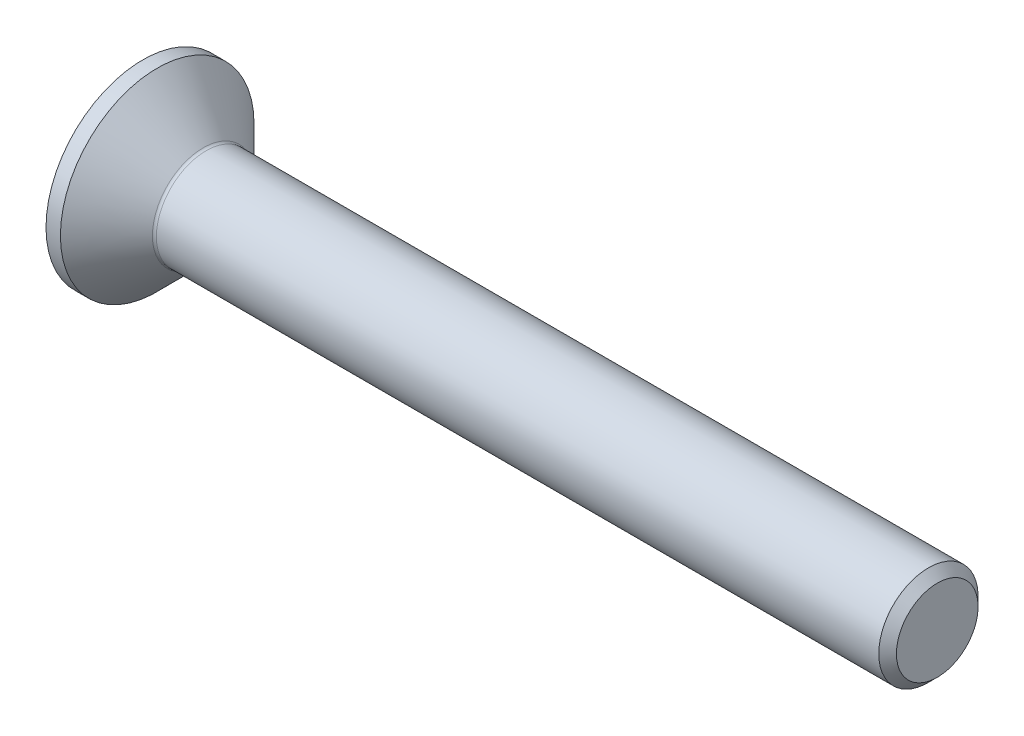
ISO-10303-21;
HEADER;
FILE_DESCRIPTION(('STEP AP214'),'2;1');
FILE_NAME('part.step','',(''),(''),'','','');
FILE_SCHEMA(('AUTOMOTIVE_DESIGN { 1 0 10303 214 1 1 1 1 }'));
ENDSEC;
DATA;
#1=APPLICATION_CONTEXT('core data for automotive mechanical design processes');
#2=APPLICATION_PROTOCOL_DEFINITION('international standard','automotive_design',2000,#1);
#3=PRODUCT_CONTEXT('',#1,'mechanical');
#4=PRODUCT('Part','Part','',(#3));
#5=PRODUCT_RELATED_PRODUCT_CATEGORY('part','',(#4));
#6=PRODUCT_DEFINITION_FORMATION('','',#4);
#7=PRODUCT_DEFINITION_CONTEXT('part definition',#1,'design');
#8=PRODUCT_DEFINITION('design','',#6,#7);
#9=PRODUCT_DEFINITION_SHAPE('','',#8);
#10=(LENGTH_UNIT() NAMED_UNIT(*) SI_UNIT(.MILLI.,.METRE.));
#11=(NAMED_UNIT(*) PLANE_ANGLE_UNIT() SI_UNIT($,.RADIAN.));
#12=(NAMED_UNIT(*) SI_UNIT($,.STERADIAN.) SOLID_ANGLE_UNIT());
#13=UNCERTAINTY_MEASURE_WITH_UNIT(LENGTH_MEASURE(1.E-05),#10,'distance_accuracy_value','');
#14=(GEOMETRIC_REPRESENTATION_CONTEXT(3) GLOBAL_UNCERTAINTY_ASSIGNED_CONTEXT((#13)) GLOBAL_UNIT_ASSIGNED_CONTEXT((#10,
#11,#12)) REPRESENTATION_CONTEXT('',''));
#15=CARTESIAN_POINT('',(0.,0.,0.));
#16=DIRECTION('',(0.,0.,1.));
#17=DIRECTION('',(1.,0.,0.));
#18=AXIS2_PLACEMENT_3D('',#15,#16,#17);
#19=CARTESIAN_POINT('',(0.,0.,0.));
#20=DIRECTION('',(-1.,0.,0.));
#21=DIRECTION('',(0.,0.,1.));
#22=AXIS2_PLACEMENT_3D('',#19,#20,#21);
#23=PLANE('',#22);
#24=CARTESIAN_POINT('',(0.,0.,0.));
#25=DIRECTION('',(-1.,0.,0.));
#26=DIRECTION('',(0.,0.,1.));
#27=AXIS2_PLACEMENT_3D('',#24,#25,#26);
#28=CIRCLE('',#27,4.875);
#29=CARTESIAN_POINT('',(0.,0.,4.875));
#30=VERTEX_POINT('',#29);
#31=EDGE_CURVE('E158',#30,#30,#28,.T.);
#32=ORIENTED_EDGE('',*,*,#31,.T.);
#33=EDGE_LOOP('',(#32));
#34=FACE_BOUND('',#33,.T.);
#35=DIRECTION('',(0.,-0.5,-0.866025403784439));
#36=VECTOR('',#35,1.);
#37=CARTESIAN_POINT('',(0.,-0.866025403784439,1.5));
#38=LINE('',#37,#36);
#39=CARTESIAN_POINT('',(0.,-0.866025403784439,1.5));
#40=VERTEX_POINT('',#39);
#41=CARTESIAN_POINT('',(0.,-1.73205080756888,0.));
#42=VERTEX_POINT('',#41);
#43=EDGE_CURVE('E120',#40,#42,#38,.T.);
#44=ORIENTED_EDGE('',*,*,#43,.T.);
#45=DIRECTION('',(0.,0.500000000000001,-0.866025403784438));
#46=VECTOR('',#45,1.);
#47=CARTESIAN_POINT('',(0.,-1.73205080756888,0.));
#48=LINE('',#47,#46);
#49=CARTESIAN_POINT('',(0.,-0.866025403784438,-1.5));
#50=VERTEX_POINT('',#49);
#51=EDGE_CURVE('E50',#42,#50,#48,.T.);
#52=ORIENTED_EDGE('',*,*,#51,.T.);
#53=DIRECTION('',(0.,1.,0.));
#54=VECTOR('',#53,1.);
#55=CARTESIAN_POINT('',(0.,-0.866025403784438,-1.5));
#56=LINE('',#55,#54);
#57=CARTESIAN_POINT('',(0.,0.866025403784438,-1.5));
#58=VERTEX_POINT('',#57);
#59=EDGE_CURVE('E135',#50,#58,#56,.T.);
#60=ORIENTED_EDGE('',*,*,#59,.T.);
#61=DIRECTION('',(0.,0.499999999999999,0.866025403784439));
#62=VECTOR('',#61,1.);
#63=CARTESIAN_POINT('',(0.,0.866025403784438,-1.5));
#64=LINE('',#63,#62);
#65=CARTESIAN_POINT('',(0.,1.73205080756888,0.));
#66=VERTEX_POINT('',#65);
#67=EDGE_CURVE('E271',#58,#66,#64,.T.);
#68=ORIENTED_EDGE('',*,*,#67,.T.);
#69=DIRECTION('',(0.,-0.5,0.866025403784439));
#70=VECTOR('',#69,1.);
#71=CARTESIAN_POINT('',(0.,1.73205080756888,0.));
#72=LINE('',#71,#70);
#73=CARTESIAN_POINT('',(0.,0.866025403784438,1.5));
#74=VERTEX_POINT('',#73);
#75=EDGE_CURVE('E274',#66,#74,#72,.T.);
#76=ORIENTED_EDGE('',*,*,#75,.T.);
#77=DIRECTION('',(0.,-1.,0.));
#78=VECTOR('',#77,1.);
#79=CARTESIAN_POINT('',(0.,0.866025403784438,1.5));
#80=LINE('',#79,#78);
#81=EDGE_CURVE('E277',#74,#40,#80,.T.);
#82=ORIENTED_EDGE('',*,*,#81,.T.);
#83=EDGE_LOOP('',(#44,#52,#60,#68,#76,#82));
#84=FACE_BOUND('',#83,.T.);
#85=ADVANCED_FACE('F35',(#34,#84),#23,.T.);
#86=CARTESIAN_POINT('',(0.,0.,0.));
#87=DIRECTION('',(-1.,0.,0.));
#88=DIRECTION('',(0.,0.,1.));
#89=AXIS2_PLACEMENT_3D('',#86,#87,#88);
#90=CYLINDRICAL_SURFACE('',#89,4.875);
#91=CARTESIAN_POINT('',(0.725000000000013,0.,0.));
#92=DIRECTION('',(-1.,0.,0.));
#93=DIRECTION('',(0.,0.,1.));
#94=AXIS2_PLACEMENT_3D('',#91,#92,#93);
#95=CIRCLE('',#94,4.875);
#96=CARTESIAN_POINT('',(0.725000000000013,0.,4.875));
#97=VERTEX_POINT('',#96);
#98=EDGE_CURVE('E155',#97,#97,#95,.T.);
#99=ORIENTED_EDGE('',*,*,#98,.T.);
#100=EDGE_LOOP('',(#99));
#101=FACE_BOUND('',#100,.T.);
#102=ORIENTED_EDGE('',*,*,#31,.F.);
#103=EDGE_LOOP('',(#102));
#104=FACE_BOUND('',#103,.T.);
#105=ADVANCED_FACE('F179',(#101,#104),#90,.T.);
#106=CARTESIAN_POINT('',(0.725000000000013,0.,0.));
#107=DIRECTION('',(-1.,0.,0.));
#108=DIRECTION('',(0.,0.,1.));
#109=AXIS2_PLACEMENT_3D('',#106,#107,#108);
#110=CONICAL_SURFACE('',#109,4.875,0.78539816339745);
#111=CARTESIAN_POINT('',(3.04142135623745,0.,0.));
#112=DIRECTION('',(-1.,0.,0.));
#113=DIRECTION('',(0.,0.,1.));
#114=AXIS2_PLACEMENT_3D('',#111,#112,#113);
#115=CIRCLE('',#114,2.55857864376256);
#116=CARTESIAN_POINT('',(3.04142135623745,0.,2.55857864376256));
#117=VERTEX_POINT('',#116);
#118=EDGE_CURVE('E43',#117,#117,#115,.T.);
#119=ORIENTED_EDGE('',*,*,#118,.T.);
#120=EDGE_LOOP('',(#119));
#121=FACE_BOUND('',#120,.T.);
#122=ORIENTED_EDGE('',*,*,#98,.F.);
#123=EDGE_LOOP('',(#122));
#124=FACE_BOUND('',#123,.T.);
#125=ADVANCED_FACE('F163',(#121,#124),#110,.T.);
#126=CARTESIAN_POINT('',(0.,0.,0.));
#127=DIRECTION('',(-1.,0.,0.));
#128=DIRECTION('',(0.,0.,1.));
#129=AXIS2_PLACEMENT_3D('',#126,#127,#128);
#130=CYLINDRICAL_SURFACE('',#129,2.49999999999987);
#131=CARTESIAN_POINT('',(3.18284271247476,0.,0.));
#132=DIRECTION('',(-1.,0.,0.));
#133=DIRECTION('',(0.,0.,1.));
#134=AXIS2_PLACEMENT_3D('',#131,#132,#133);
#135=CIRCLE('',#134,2.49999999999987);
#136=CARTESIAN_POINT('',(3.18284271247476,0.,2.49999999999987));
#137=VERTEX_POINT('',#136);
#138=EDGE_CURVE('E11',#137,#137,#135,.F.);
#139=ORIENTED_EDGE('',*,*,#138,.T.);
#140=EDGE_LOOP('',(#139));
#141=FACE_BOUND('',#140,.T.);
#142=CARTESIAN_POINT('',(39.5549999999997,0.,0.));
#143=DIRECTION('',(-1.,0.,0.));
#144=DIRECTION('',(0.,0.,1.));
#145=AXIS2_PLACEMENT_3D('',#142,#143,#144);
#146=CIRCLE('',#145,2.49999999999973);
#147=CARTESIAN_POINT('',(39.5549999999997,0.,2.49999999999973));
#148=VERTEX_POINT('',#147);
#149=EDGE_CURVE('E152',#148,#148,#146,.T.);
#150=ORIENTED_EDGE('',*,*,#149,.T.);
#151=EDGE_LOOP('',(#150));
#152=FACE_BOUND('',#151,.T.);
#153=ADVANCED_FACE('F190',(#141,#152),#130,.T.);
#154=CARTESIAN_POINT('',(40.,0.,0.));
#155=DIRECTION('',(-1.,0.,0.));
#156=DIRECTION('',(0.,0.,1.));
#157=AXIS2_PLACEMENT_3D('',#154,#155,#156);
#158=CONICAL_SURFACE('',#157,2.055,0.785398163396857);
#159=ORIENTED_EDGE('',*,*,#149,.F.);
#160=EDGE_LOOP('',(#159));
#161=FACE_BOUND('',#160,.T.);
#162=CARTESIAN_POINT('',(40.,0.,0.));
#163=DIRECTION('',(-1.,0.,0.));
#164=DIRECTION('',(0.,0.,1.));
#165=AXIS2_PLACEMENT_3D('',#162,#163,#164);
#166=CIRCLE('',#165,2.055);
#167=CARTESIAN_POINT('',(40.,0.,2.055));
#168=VERTEX_POINT('',#167);
#169=EDGE_CURVE('E148',#168,#168,#166,.T.);
#170=ORIENTED_EDGE('',*,*,#169,.T.);
#171=EDGE_LOOP('',(#170));
#172=FACE_BOUND('',#171,.T.);
#173=ADVANCED_FACE('F174',(#161,#172),#158,.T.);
#174=CARTESIAN_POINT('',(40.,2.055,0.));
#175=DIRECTION('',(1.,0.,0.));
#176=DIRECTION('',(0.,0.,-1.));
#177=AXIS2_PLACEMENT_3D('',#174,#175,#176);
#178=PLANE('',#177);
#179=ORIENTED_EDGE('',*,*,#169,.F.);
#180=EDGE_LOOP('',(#179));
#181=FACE_BOUND('',#180,.T.);
#182=ADVANCED_FACE('F167',(#181),#178,.T.);
#183=CARTESIAN_POINT('',(3.18284271247476,0.,0.));
#184=DIRECTION('',(-1.,0.,0.));
#185=DIRECTION('',(0.,0.,1.));
#186=AXIS2_PLACEMENT_3D('',#183,#184,#185);
#187=TOROIDAL_SURFACE('',#186,2.69999999999987,0.2);
#188=ORIENTED_EDGE('',*,*,#138,.F.);
#189=EDGE_LOOP('',(#188));
#190=FACE_BOUND('',#189,.T.);
#191=ORIENTED_EDGE('',*,*,#118,.F.);
#192=EDGE_LOOP('',(#191));
#193=FACE_BOUND('',#192,.T.);
#194=ADVANCED_FACE('F37',(#190,#193),#187,.F.);
#195=CARTESIAN_POINT('',(1.9,-1.73205080756888,0.));
#196=DIRECTION('',(0.,0.866025403784438,0.500000000000001));
#197=DIRECTION('',(0.,-0.500000000000001,0.866025403784438));
#198=AXIS2_PLACEMENT_3D('',#195,#196,#197);
#199=PLANE('',#198);
#200=ORIENTED_EDGE('',*,*,#51,.F.);
#201=DIRECTION('',(-1.,0.,0.));
#202=VECTOR('',#201,1.);
#203=CARTESIAN_POINT('',(1.9,-1.73205080756888,0.));
#204=LINE('',#203,#202);
#205=CARTESIAN_POINT('',(1.9,-1.73205080756888,0.));
#206=VERTEX_POINT('',#205);
#207=EDGE_CURVE('E268',#206,#42,#204,.T.);
#208=ORIENTED_EDGE('',*,*,#207,.F.);
#209=DIRECTION('',(0.,0.500000000000001,-0.866025403784438));
#210=VECTOR('',#209,1.);
#211=CARTESIAN_POINT('',(1.9,-1.73205080756888,0.));
#212=LINE('',#211,#210);
#213=CARTESIAN_POINT('',(1.9,-1.29903810567666,-0.750000000000001));
#214=VERTEX_POINT('',#213);
#215=EDGE_CURVE('E117',#206,#214,#212,.T.);
#216=ORIENTED_EDGE('',*,*,#215,.T.);
#217=CARTESIAN_POINT('',(1.9,-0.866025403784438,-1.5));
#218=VERTEX_POINT('',#217);
#219=EDGE_CURVE('E111',#214,#218,#212,.T.);
#220=ORIENTED_EDGE('',*,*,#219,.T.);
#221=DIRECTION('',(-1.,0.,0.));
#222=VECTOR('',#221,1.);
#223=CARTESIAN_POINT('',(1.9,-0.866025403784438,-1.5));
#224=LINE('',#223,#222);
#225=EDGE_CURVE('E115',#218,#50,#224,.T.);
#226=ORIENTED_EDGE('',*,*,#225,.T.);
#227=EDGE_LOOP('',(#200,#208,#216,#220,#226));
#228=FACE_BOUND('',#227,.T.);
#229=ADVANCED_FACE('F113',(#228),#199,.T.);
#230=CARTESIAN_POINT('',(1.9,-0.866025403784438,-1.5));
#231=DIRECTION('',(0.,0.,1.));
#232=DIRECTION('',(0.,-1.,0.));
#233=AXIS2_PLACEMENT_3D('',#230,#231,#232);
#234=PLANE('',#233);
#235=ORIENTED_EDGE('',*,*,#59,.F.);
#236=ORIENTED_EDGE('',*,*,#225,.F.);
#237=DIRECTION('',(0.,1.,0.));
#238=VECTOR('',#237,1.);
#239=CARTESIAN_POINT('',(1.9,-0.866025403784438,-1.5));
#240=LINE('',#239,#238);
#241=CARTESIAN_POINT('',(1.9,0.,-1.5));
#242=VERTEX_POINT('',#241);
#243=EDGE_CURVE('E123',#218,#242,#240,.T.);
#244=ORIENTED_EDGE('',*,*,#243,.T.);
#245=CARTESIAN_POINT('',(1.9,0.866025403784438,-1.5));
#246=VERTEX_POINT('',#245);
#247=EDGE_CURVE('E130',#242,#246,#240,.T.);
#248=ORIENTED_EDGE('',*,*,#247,.T.);
#249=DIRECTION('',(-1.,0.,0.));
#250=VECTOR('',#249,1.);
#251=CARTESIAN_POINT('',(1.9,0.866025403784438,-1.5));
#252=LINE('',#251,#250);
#253=EDGE_CURVE('E137',#246,#58,#252,.T.);
#254=ORIENTED_EDGE('',*,*,#253,.T.);
#255=EDGE_LOOP('',(#235,#236,#244,#248,#254));
#256=FACE_BOUND('',#255,.T.);
#257=ADVANCED_FACE('F132',(#256),#234,.T.);
#258=CARTESIAN_POINT('',(1.9,0.866025403784438,-1.5));
#259=DIRECTION('',(0.,-0.866025403784439,0.499999999999999));
#260=DIRECTION('',(0.,-0.499999999999999,-0.866025403784439));
#261=AXIS2_PLACEMENT_3D('',#258,#259,#260);
#262=PLANE('',#261);
#263=ORIENTED_EDGE('',*,*,#67,.F.);
#264=ORIENTED_EDGE('',*,*,#253,.F.);
#265=DIRECTION('',(0.,0.499999999999999,0.866025403784439));
#266=VECTOR('',#265,1.);
#267=CARTESIAN_POINT('',(1.9,0.866025403784438,-1.5));
#268=LINE('',#267,#266);
#269=CARTESIAN_POINT('',(1.9,1.29903810567666,-0.749999999999998));
#270=VERTEX_POINT('',#269);
#271=EDGE_CURVE('E260',#246,#270,#268,.T.);
#272=ORIENTED_EDGE('',*,*,#271,.T.);
#273=CARTESIAN_POINT('',(1.9,1.73205080756888,0.));
#274=VERTEX_POINT('',#273);
#275=EDGE_CURVE('E129',#270,#274,#268,.T.);
#276=ORIENTED_EDGE('',*,*,#275,.T.);
#277=DIRECTION('',(-1.,0.,0.));
#278=VECTOR('',#277,1.);
#279=CARTESIAN_POINT('',(1.9,1.73205080756888,0.));
#280=LINE('',#279,#278);
#281=EDGE_CURVE('E143',#274,#66,#280,.T.);
#282=ORIENTED_EDGE('',*,*,#281,.T.);
#283=EDGE_LOOP('',(#263,#264,#272,#276,#282));
#284=FACE_BOUND('',#283,.T.);
#285=ADVANCED_FACE('F204',(#284),#262,.T.);
#286=CARTESIAN_POINT('',(1.9,1.73205080756888,0.));
#287=DIRECTION('',(0.,-0.866025403784439,-0.5));
#288=DIRECTION('',(0.,0.5,-0.866025403784439));
#289=AXIS2_PLACEMENT_3D('',#286,#287,#288);
#290=PLANE('',#289);
#291=ORIENTED_EDGE('',*,*,#75,.F.);
#292=ORIENTED_EDGE('',*,*,#281,.F.);
#293=DIRECTION('',(0.,-0.5,0.866025403784439));
#294=VECTOR('',#293,1.);
#295=CARTESIAN_POINT('',(1.9,1.73205080756888,0.));
#296=LINE('',#295,#294);
#297=CARTESIAN_POINT('',(1.9,1.29903810567666,0.749999999999999));
#298=VERTEX_POINT('',#297);
#299=EDGE_CURVE('E58',#274,#298,#296,.T.);
#300=ORIENTED_EDGE('',*,*,#299,.T.);
#301=CARTESIAN_POINT('',(1.9,0.866025403784438,1.5));
#302=VERTEX_POINT('',#301);
#303=EDGE_CURVE('E239',#298,#302,#296,.T.);
#304=ORIENTED_EDGE('',*,*,#303,.T.);
#305=DIRECTION('',(-1.,0.,0.));
#306=VECTOR('',#305,1.);
#307=CARTESIAN_POINT('',(1.9,0.866025403784438,1.5));
#308=LINE('',#307,#306);
#309=EDGE_CURVE('E253',#302,#74,#308,.T.);
#310=ORIENTED_EDGE('',*,*,#309,.T.);
#311=EDGE_LOOP('',(#291,#292,#300,#304,#310));
#312=FACE_BOUND('',#311,.T.);
#313=ADVANCED_FACE('F207',(#312),#290,.T.);
#314=CARTESIAN_POINT('',(1.9,0.866025403784438,1.5));
#315=DIRECTION('',(0.,0.,-1.));
#316=DIRECTION('',(0.,1.,0.));
#317=AXIS2_PLACEMENT_3D('',#314,#315,#316);
#318=PLANE('',#317);
#319=ORIENTED_EDGE('',*,*,#81,.F.);
#320=ORIENTED_EDGE('',*,*,#309,.F.);
#321=DIRECTION('',(0.,-1.,0.));
#322=VECTOR('',#321,1.);
#323=CARTESIAN_POINT('',(1.9,0.866025403784438,1.5));
#324=LINE('',#323,#322);
#325=CARTESIAN_POINT('',(1.9,0.,1.5));
#326=VERTEX_POINT('',#325);
#327=EDGE_CURVE('E238',#302,#326,#324,.T.);
#328=ORIENTED_EDGE('',*,*,#327,.T.);
#329=CARTESIAN_POINT('',(1.9,-0.866025403784439,1.5));
#330=VERTEX_POINT('',#329);
#331=EDGE_CURVE('E244',#326,#330,#324,.T.);
#332=ORIENTED_EDGE('',*,*,#331,.T.);
#333=DIRECTION('',(-1.,0.,0.));
#334=VECTOR('',#333,1.);
#335=CARTESIAN_POINT('',(1.9,-0.866025403784439,1.5));
#336=LINE('',#335,#334);
#337=EDGE_CURVE('E283',#330,#40,#336,.T.);
#338=ORIENTED_EDGE('',*,*,#337,.T.);
#339=EDGE_LOOP('',(#319,#320,#328,#332,#338));
#340=FACE_BOUND('',#339,.T.);
#341=ADVANCED_FACE('F211',(#340),#318,.T.);
#342=CARTESIAN_POINT('',(1.9,-0.866025403784439,1.5));
#343=DIRECTION('',(0.,0.866025403784438,-0.5));
#344=DIRECTION('',(0.,0.5,0.866025403784439));
#345=AXIS2_PLACEMENT_3D('',#342,#343,#344);
#346=PLANE('',#345);
#347=ORIENTED_EDGE('',*,*,#43,.F.);
#348=ORIENTED_EDGE('',*,*,#337,.F.);
#349=DIRECTION('',(0.,-0.5,-0.866025403784439));
#350=VECTOR('',#349,1.);
#351=CARTESIAN_POINT('',(1.9,-0.866025403784439,1.5));
#352=LINE('',#351,#350);
#353=CARTESIAN_POINT('',(1.9,-1.29903810567666,0.75));
#354=VERTEX_POINT('',#353);
#355=EDGE_CURVE('E247',#330,#354,#352,.T.);
#356=ORIENTED_EDGE('',*,*,#355,.T.);
#357=EDGE_CURVE('E254',#354,#206,#352,.T.);
#358=ORIENTED_EDGE('',*,*,#357,.T.);
#359=ORIENTED_EDGE('',*,*,#207,.T.);
#360=EDGE_LOOP('',(#347,#348,#356,#358,#359));
#361=FACE_BOUND('',#360,.T.);
#362=ADVANCED_FACE('F214',(#361),#346,.T.);
#363=CARTESIAN_POINT('',(1.9,-1.73205080756888,0.));
#364=DIRECTION('',(-1.,0.,0.));
#365=DIRECTION('',(0.,0.,1.));
#366=AXIS2_PLACEMENT_3D('',#363,#364,#365);
#367=PLANE('',#366);
#368=CARTESIAN_POINT('',(1.9,0.,0.));
#369=DIRECTION('',(-1.,0.,0.));
#370=DIRECTION('',(0.,0.,1.));
#371=AXIS2_PLACEMENT_3D('',#368,#369,#370);
#372=CIRCLE('',#371,1.5);
#373=EDGE_CURVE('E136',#354,#326,#372,.T.);
#374=ORIENTED_EDGE('',*,*,#373,.F.);
#375=ORIENTED_EDGE('',*,*,#355,.F.);
#376=ORIENTED_EDGE('',*,*,#331,.F.);
#377=EDGE_LOOP('',(#374,#375,#376));
#378=FACE_BOUND('',#377,.T.);
#379=ADVANCED_FACE('F218',(#378),#367,.T.);
#380=EDGE_CURVE('E140',#214,#354,#372,.T.);
#381=ORIENTED_EDGE('',*,*,#380,.F.);
#382=ORIENTED_EDGE('',*,*,#215,.F.);
#383=ORIENTED_EDGE('',*,*,#357,.F.);
#384=EDGE_LOOP('',(#381,#382,#383));
#385=FACE_BOUND('',#384,.T.);
#386=ADVANCED_FACE('F221',(#385),#367,.T.);
#387=EDGE_CURVE('E125',#242,#214,#372,.T.);
#388=ORIENTED_EDGE('',*,*,#387,.F.);
#389=ORIENTED_EDGE('',*,*,#243,.F.);
#390=ORIENTED_EDGE('',*,*,#219,.F.);
#391=EDGE_LOOP('',(#388,#389,#390));
#392=FACE_BOUND('',#391,.T.);
#393=ADVANCED_FACE('F124',(#392),#367,.T.);
#394=EDGE_CURVE('E256',#270,#242,#372,.T.);
#395=ORIENTED_EDGE('',*,*,#394,.F.);
#396=ORIENTED_EDGE('',*,*,#271,.F.);
#397=ORIENTED_EDGE('',*,*,#247,.F.);
#398=EDGE_LOOP('',(#395,#396,#397));
#399=FACE_BOUND('',#398,.T.);
#400=ADVANCED_FACE('F233',(#399),#367,.T.);
#401=EDGE_CURVE('E149',#298,#270,#372,.T.);
#402=ORIENTED_EDGE('',*,*,#401,.F.);
#403=ORIENTED_EDGE('',*,*,#299,.F.);
#404=ORIENTED_EDGE('',*,*,#275,.F.);
#405=EDGE_LOOP('',(#402,#403,#404));
#406=FACE_BOUND('',#405,.T.);
#407=ADVANCED_FACE('F228',(#406),#367,.T.);
#408=EDGE_CURVE('E142',#326,#298,#372,.T.);
#409=ORIENTED_EDGE('',*,*,#408,.F.);
#410=ORIENTED_EDGE('',*,*,#327,.F.);
#411=ORIENTED_EDGE('',*,*,#303,.F.);
#412=EDGE_LOOP('',(#409,#410,#411));
#413=FACE_BOUND('',#412,.T.);
#414=ADVANCED_FACE('F199',(#413),#367,.T.);
#415=CARTESIAN_POINT('',(1.9,0.,0.));
#416=DIRECTION('',(-1.,0.,0.));
#417=DIRECTION('',(0.,0.,1.));
#418=AXIS2_PLACEMENT_3D('',#415,#416,#417);
#419=CONICAL_SURFACE('',#418,1.5,1.04719755119659);
#420=CARTESIAN_POINT('',(2.76602540378445,0.,0.));
#421=VERTEX_POINT('',#420);
#422=VERTEX_LOOP('',#421);
#423=FACE_BOUND('',#422,.T.);
#424=ORIENTED_EDGE('',*,*,#408,.T.);
#425=ORIENTED_EDGE('',*,*,#401,.T.);
#426=ORIENTED_EDGE('',*,*,#394,.T.);
#427=ORIENTED_EDGE('',*,*,#387,.T.);
#428=ORIENTED_EDGE('',*,*,#380,.T.);
#429=ORIENTED_EDGE('',*,*,#373,.T.);
#430=EDGE_LOOP('',(#424,#425,#426,#427,#428,#429));
#431=FACE_BOUND('',#430,.T.);
#432=ADVANCED_FACE('F197',(#423,#431),#419,.F.);
#433=CLOSED_SHELL('',(#85,#105,#125,#153,#173,#182,#194,#229,#257,#285,#313,#341,#362,#379,#386,
#393,#400,#407,#414,#432));
#434=MANIFOLD_SOLID_BREP('B2',#433);
#435=ADVANCED_BREP_SHAPE_REPRESENTATION('',(#18,#434),#14);
#436=SHAPE_DEFINITION_REPRESENTATION(#9,#435);
ENDSEC;
END-ISO-10303-21;
